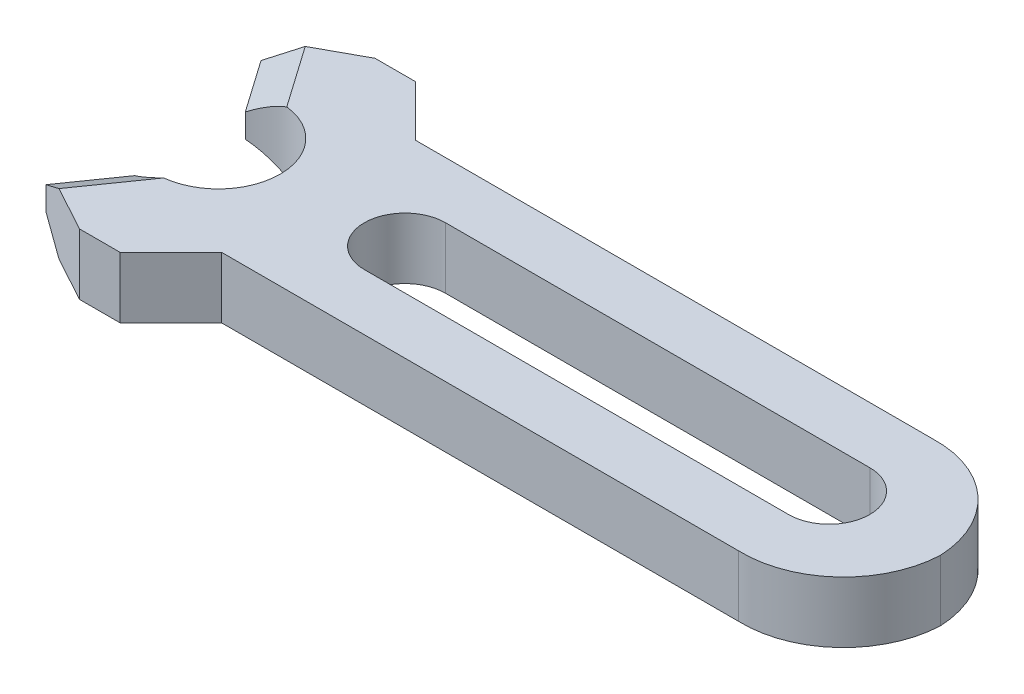
ISO-10303-21;
HEADER;
FILE_DESCRIPTION(('STEP AP214'),'2;1');
FILE_NAME('part.step','',(''),(''),'','','');
FILE_SCHEMA(('AUTOMOTIVE_DESIGN { 1 0 10303 214 1 1 1 1 }'));
ENDSEC;
DATA;
#1=APPLICATION_CONTEXT('core data for automotive mechanical design processes');
#2=APPLICATION_PROTOCOL_DEFINITION('international standard','automotive_design',2000,#1);
#3=PRODUCT_CONTEXT('',#1,'mechanical');
#4=PRODUCT('Part','Part','',(#3));
#5=PRODUCT_RELATED_PRODUCT_CATEGORY('part','',(#4));
#6=PRODUCT_DEFINITION_FORMATION('','',#4);
#7=PRODUCT_DEFINITION_CONTEXT('part definition',#1,'design');
#8=PRODUCT_DEFINITION('design','',#6,#7);
#9=PRODUCT_DEFINITION_SHAPE('','',#8);
#10=(LENGTH_UNIT() NAMED_UNIT(*) SI_UNIT(.MILLI.,.METRE.));
#11=(NAMED_UNIT(*) PLANE_ANGLE_UNIT() SI_UNIT($,.RADIAN.));
#12=(NAMED_UNIT(*) SI_UNIT($,.STERADIAN.) SOLID_ANGLE_UNIT());
#13=UNCERTAINTY_MEASURE_WITH_UNIT(LENGTH_MEASURE(1.E-05),#10,'distance_accuracy_value','');
#14=(GEOMETRIC_REPRESENTATION_CONTEXT(3) GLOBAL_UNCERTAINTY_ASSIGNED_CONTEXT((#13)) GLOBAL_UNIT_ASSIGNED_CONTEXT((#10,
#11,#12)) REPRESENTATION_CONTEXT('',''));
#15=CARTESIAN_POINT('',(0.,0.,0.));
#16=DIRECTION('',(0.,0.,1.));
#17=DIRECTION('',(1.,0.,0.));
#18=AXIS2_PLACEMENT_3D('',#15,#16,#17);
#19=CARTESIAN_POINT('',(7.60352570186957,3.8227,0.204369265688564));
#20=DIRECTION('',(0.,-1.,0.));
#21=DIRECTION('',(0.,0.,-1.));
#22=AXIS2_PLACEMENT_3D('',#19,#20,#21);
#23=CYLINDRICAL_SURFACE('',#22,6.35342707429372);
#24=CARTESIAN_POINT('',(7.60352570186957,0.,0.204369265688564));
#25=DIRECTION('',(0.,1.,0.));
#26=DIRECTION('',(0.,0.,1.));
#27=AXIS2_PLACEMENT_3D('',#24,#25,#26);
#28=CIRCLE('',#27,6.35342707429372);
#29=CARTESIAN_POINT('',(13.9507690040802,0.,-0.0758771453703794));
#30=VERTEX_POINT('',#29);
#31=CARTESIAN_POINT('',(7.39487386658286,0.,-6.14563073431144));
#32=VERTEX_POINT('',#31);
#33=EDGE_CURVE('E274',#30,#32,#28,.T.);
#34=ORIENTED_EDGE('',*,*,#33,.T.);
#35=DIRECTION('',(0.,-1.,0.));
#36=VECTOR('',#35,1.);
#37=CARTESIAN_POINT('',(7.39487386658286,3.8227,-6.14563073431144));
#38=LINE('',#37,#36);
#39=CARTESIAN_POINT('',(7.39487386658286,3.8227,-6.14563073431144));
#40=VERTEX_POINT('',#39);
#41=EDGE_CURVE('E334',#40,#32,#38,.T.);
#42=ORIENTED_EDGE('',*,*,#41,.F.);
#43=CARTESIAN_POINT('',(7.60352570186957,3.8227,0.204369265688564));
#44=DIRECTION('',(0.,1.,0.));
#45=DIRECTION('',(0.,0.,1.));
#46=AXIS2_PLACEMENT_3D('',#43,#44,#45);
#47=CIRCLE('',#46,6.35342707429372);
#48=CARTESIAN_POINT('',(13.9507690040802,3.8227,-0.0758771453703794));
#49=VERTEX_POINT('',#48);
#50=EDGE_CURVE('E275',#49,#40,#47,.T.);
#51=ORIENTED_EDGE('',*,*,#50,.F.);
#52=DIRECTION('',(0.,-1.,0.));
#53=VECTOR('',#52,1.);
#54=CARTESIAN_POINT('',(13.9507690040802,3.8227,-0.0758771453703568));
#55=LINE('',#54,#53);
#56=EDGE_CURVE('E202',#49,#30,#55,.T.);
#57=ORIENTED_EDGE('',*,*,#56,.T.);
#58=EDGE_LOOP('',(#34,#42,#51,#57));
#59=FACE_BOUND('',#58,.T.);
#60=ADVANCED_FACE('F35',(#59),#23,.T.);
#61=CARTESIAN_POINT('',(0.,3.8227,-6.14563073431143));
#62=DIRECTION('',(0.,0.,1.));
#63=DIRECTION('',(1.,0.,0.));
#64=AXIS2_PLACEMENT_3D('',#61,#62,#63);
#65=PLANE('',#64);
#66=DIRECTION('',(-1.,0.,0.));
#67=VECTOR('',#66,1.);
#68=CARTESIAN_POINT('',(0.,0.,-6.14563073431143));
#69=LINE('',#68,#67);
#70=CARTESIAN_POINT('',(-24.9538224628437,0.,-6.14563073431143));
#71=VERTEX_POINT('',#70);
#72=EDGE_CURVE('E299',#32,#71,#69,.T.);
#73=ORIENTED_EDGE('',*,*,#72,.T.);
#74=DIRECTION('',(0.,-1.,0.));
#75=VECTOR('',#74,1.);
#76=CARTESIAN_POINT('',(-24.9538224628437,3.8227,-6.14563073431143));
#77=LINE('',#76,#75);
#78=CARTESIAN_POINT('',(-24.9538224628437,3.8227,-6.14563073431143));
#79=VERTEX_POINT('',#78);
#80=EDGE_CURVE('E331',#79,#71,#77,.T.);
#81=ORIENTED_EDGE('',*,*,#80,.F.);
#82=DIRECTION('',(-1.,0.,0.));
#83=VECTOR('',#82,1.);
#84=CARTESIAN_POINT('',(0.,3.8227,-6.14563073431143));
#85=LINE('',#84,#83);
#86=EDGE_CURVE('E277',#40,#79,#85,.T.);
#87=ORIENTED_EDGE('',*,*,#86,.F.);
#88=ORIENTED_EDGE('',*,*,#41,.T.);
#89=EDGE_LOOP('',(#73,#81,#87,#88));
#90=FACE_BOUND('',#89,.T.);
#91=ADVANCED_FACE('F382',(#90),#65,.F.);
#92=CARTESIAN_POINT('',(-9.40409586426615,3.8227,9.40409586426614));
#93=DIRECTION('',(-0.707106781186548,0.,0.707106781186547));
#94=DIRECTION('',(0.707106781186547,0.,0.707106781186548));
#95=AXIS2_PLACEMENT_3D('',#92,#93,#94);
#96=PLANE('',#95);
#97=DIRECTION('',(-0.707106781186547,0.,-0.707106781186548));
#98=VECTOR('',#97,1.);
#99=CARTESIAN_POINT('',(-9.40409586426615,0.,9.40409586426614));
#100=LINE('',#99,#98);
#101=CARTESIAN_POINT('',(-28.1288224628437,0.,-9.32063073431143));
#102=VERTEX_POINT('',#101);
#103=EDGE_CURVE('E301',#71,#102,#100,.T.);
#104=ORIENTED_EDGE('',*,*,#103,.T.);
#105=DIRECTION('',(0.,-1.,0.));
#106=VECTOR('',#105,1.);
#107=CARTESIAN_POINT('',(-28.1288224628437,3.8227,-9.32063073431143));
#108=LINE('',#107,#106);
#109=CARTESIAN_POINT('',(-28.1288224628437,3.8227,-9.32063073431143));
#110=VERTEX_POINT('',#109);
#111=EDGE_CURVE('E328',#110,#102,#108,.T.);
#112=ORIENTED_EDGE('',*,*,#111,.F.);
#113=DIRECTION('',(-0.707106781186547,0.,-0.707106781186548));
#114=VECTOR('',#113,1.);
#115=CARTESIAN_POINT('',(-9.40409586426615,3.8227,9.40409586426614));
#116=LINE('',#115,#114);
#117=EDGE_CURVE('E280',#79,#110,#116,.T.);
#118=ORIENTED_EDGE('',*,*,#117,.F.);
#119=ORIENTED_EDGE('',*,*,#80,.T.);
#120=EDGE_LOOP('',(#104,#112,#118,#119));
#121=FACE_BOUND('',#120,.T.);
#122=ADVANCED_FACE('F388',(#121),#96,.F.);
#123=CARTESIAN_POINT('',(0.,3.8227,-9.3206307343114));
#124=DIRECTION('',(0.,0.,1.));
#125=DIRECTION('',(1.,0.,0.));
#126=AXIS2_PLACEMENT_3D('',#123,#124,#125);
#127=PLANE('',#126);
#128=DIRECTION('',(-1.,0.,0.));
#129=VECTOR('',#128,1.);
#130=CARTESIAN_POINT('',(0.,0.,-9.3206307343114));
#131=LINE('',#130,#129);
#132=CARTESIAN_POINT('',(-30.6688224628437,0.,-9.32063073431144));
#133=VERTEX_POINT('',#132);
#134=EDGE_CURVE('E303',#102,#133,#131,.T.);
#135=ORIENTED_EDGE('',*,*,#134,.T.);
#136=DIRECTION('',(0.,-1.,0.));
#137=VECTOR('',#136,1.);
#138=CARTESIAN_POINT('',(-30.6688224628437,3.8227,-9.32063073431144));
#139=LINE('',#138,#137);
#140=CARTESIAN_POINT('',(-30.6688224628437,3.8227,-9.32063073431144));
#141=VERTEX_POINT('',#140);
#142=EDGE_CURVE('E325',#141,#133,#139,.T.);
#143=ORIENTED_EDGE('',*,*,#142,.F.);
#144=DIRECTION('',(-1.,0.,0.));
#145=VECTOR('',#144,1.);
#146=CARTESIAN_POINT('',(0.,3.8227,-9.3206307343114));
#147=LINE('',#146,#145);
#148=EDGE_CURVE('E282',#110,#141,#147,.T.);
#149=ORIENTED_EDGE('',*,*,#148,.F.);
#150=ORIENTED_EDGE('',*,*,#111,.T.);
#151=EDGE_LOOP('',(#135,#143,#149,#150));
#152=FACE_BOUND('',#151,.T.);
#153=ADVANCED_FACE('F394',(#152),#127,.F.);
#154=CARTESIAN_POINT('',(-10.9532739393627,3.8227,-20.0768111805315));
#155=DIRECTION('',(0.478929164813691,0.,0.877853549910724));
#156=DIRECTION('',(0.877853549910724,0.,-0.478929164813691));
#157=AXIS2_PLACEMENT_3D('',#154,#155,#156);
#158=PLANE('',#157);
#159=DIRECTION('',(-0.877853549910724,0.,0.478929164813692));
#160=VECTOR('',#159,1.);
#161=CARTESIAN_POINT('',(-10.9532739393627,0.,-20.0768111805315));
#162=LINE('',#161,#160);
#163=CARTESIAN_POINT('',(-33.4943829838272,0.,-7.77909417552803));
#164=VERTEX_POINT('',#163);
#165=EDGE_CURVE('E305',#133,#164,#162,.T.);
#166=ORIENTED_EDGE('',*,*,#165,.T.);
#167=DIRECTION('',(0.761421306179294,-0.497668843247582,-0.41540741081116));
#168=VECTOR('',#167,1.);
#169=CARTESIAN_POINT('',(-33.3889183444022,-0.0689322254055946,-7.8366323510954));
#170=LINE('',#169,#168);
#171=CARTESIAN_POINT('',(-35.2844547158978,1.17,-6.80248758814867));
#172=VERTEX_POINT('',#171);
#173=EDGE_CURVE('E43',#164,#172,#170,.F.);
#174=ORIENTED_EDGE('',*,*,#173,.T.);
#175=DIRECTION('',(0.,-1.,0.));
#176=VECTOR('',#175,1.);
#177=CARTESIAN_POINT('',(-35.2844547158978,3.8227,-6.80248758814867));
#178=LINE('',#177,#176);
#179=CARTESIAN_POINT('',(-35.2844547158978,2.65270000000001,-6.80248758814867));
#180=VERTEX_POINT('',#179);
#181=EDGE_CURVE('E322',#180,#172,#178,.T.);
#182=ORIENTED_EDGE('',*,*,#181,.F.);
#183=DIRECTION('',(0.761421306179294,0.497668843247581,-0.41540741081116));
#184=VECTOR('',#183,1.);
#185=CARTESIAN_POINT('',(-31.6154994524651,5.05074784428992,-8.80415367497296));
#186=LINE('',#185,#184);
#187=CARTESIAN_POINT('',(-33.4943829838272,3.8227,-7.77909417552803));
#188=VERTEX_POINT('',#187);
#189=EDGE_CURVE('E50',#180,#188,#186,.T.);
#190=ORIENTED_EDGE('',*,*,#189,.T.);
#191=DIRECTION('',(-0.877853549910724,0.,0.478929164813692));
#192=VECTOR('',#191,1.);
#193=CARTESIAN_POINT('',(-10.9532739393627,3.8227,-20.0768111805315));
#194=LINE('',#193,#192);
#195=EDGE_CURVE('E284',#141,#188,#194,.T.);
#196=ORIENTED_EDGE('',*,*,#195,.F.);
#197=ORIENTED_EDGE('',*,*,#142,.T.);
#198=EDGE_LOOP('',(#166,#174,#182,#190,#196,#197));
#199=FACE_BOUND('',#198,.T.);
#200=ADVANCED_FACE('F348',(#199),#158,.F.);
#201=CARTESIAN_POINT('',(-20.4801007927129,3.8227,14.3403209583524));
#202=DIRECTION('',(0.819152044288988,0.,-0.573576436351051));
#203=DIRECTION('',(-0.573576436351051,0.,-0.819152044288988));
#204=AXIS2_PLACEMENT_3D('',#201,#202,#203);
#205=PLANE('',#204);
#206=ORIENTED_EDGE('',*,*,#181,.T.);
#207=DIRECTION('',(0.573576436351051,0.,0.819152044288988));
#208=VECTOR('',#207,1.);
#209=CARTESIAN_POINT('',(-20.4801007927129,1.17,14.3403209583524));
#210=LINE('',#209,#208);
#211=CARTESIAN_POINT('',(-32.9901489704936,1.17,-3.52587941099272));
#212=VERTEX_POINT('',#211);
#213=EDGE_CURVE('E339',#172,#212,#210,.T.);
#214=ORIENTED_EDGE('',*,*,#213,.T.);
#215=DIRECTION('',(0.,-1.,0.));
#216=VECTOR('',#215,1.);
#217=CARTESIAN_POINT('',(-32.9901489704936,3.8227,-3.52587941099272));
#218=LINE('',#217,#216);
#219=CARTESIAN_POINT('',(-32.9901489704936,2.65270000000001,-3.52587941099272));
#220=VERTEX_POINT('',#219);
#221=EDGE_CURVE('E319',#220,#212,#218,.T.);
#222=ORIENTED_EDGE('',*,*,#221,.F.);
#223=DIRECTION('',(-0.573576436351051,0.,-0.819152044288988));
#224=VECTOR('',#223,1.);
#225=CARTESIAN_POINT('',(-35.2844547158978,2.65270000000001,-6.80248758814867));
#226=LINE('',#225,#224);
#227=EDGE_CURVE('E337',#220,#180,#226,.T.);
#228=ORIENTED_EDGE('',*,*,#227,.T.);
#229=EDGE_LOOP('',(#206,#214,#222,#228));
#230=FACE_BOUND('',#229,.T.);
#231=ADVANCED_FACE('F352',(#230),#205,.F.);
#232=CARTESIAN_POINT('',(-31.2290451640129,3.8227,-0.0758771453703807));
#233=DIRECTION('',(0.,-1.,0.));
#234=DIRECTION('',(0.,0.,-1.));
#235=AXIS2_PLACEMENT_3D('',#232,#233,#234);
#236=CYLINDRICAL_SURFACE('',#235,3.87350000000001);
#237=ORIENTED_EDGE('',*,*,#221,.T.);
#238=CARTESIAN_POINT('',(-31.2290451640129,1.47959150810801,-0.0758771453703807));
#239=DIRECTION('',(0.409576022144494,0.866025403784438,-0.286788218175526));
#240=DIRECTION('',(0.70940647991622,-0.5,-0.496731764892158));
#241=AXIS2_PLACEMENT_3D('',#238,#239,#240);
#242=ELLIPSE('',#241,4.47273253541204,3.87350000000001);
#243=CARTESIAN_POINT('',(-30.7957648174462,0.,-3.92506802025292));
#244=VERTEX_POINT('',#243);
#245=EDGE_CURVE('E344',#212,#244,#242,.F.);
#246=ORIENTED_EDGE('',*,*,#245,.T.);
#247=CARTESIAN_POINT('',(-31.2290451640129,0.,-0.0758771453703807));
#248=DIRECTION('',(0.,1.,0.));
#249=DIRECTION('',(0.,0.,1.));
#250=AXIS2_PLACEMENT_3D('',#247,#248,#249);
#251=CIRCLE('',#250,3.87350000000001);
#252=CARTESIAN_POINT('',(-30.7957648174462,0.,3.77331372951217));
#253=VERTEX_POINT('',#252);
#254=EDGE_CURVE('E307',#253,#244,#251,.T.);
#255=ORIENTED_EDGE('',*,*,#254,.F.);
#256=CARTESIAN_POINT('',(-31.2290451640129,1.47959150810801,-0.0758771453703719));
#257=DIRECTION('',(-0.409576022144494,-0.866025403784438,-0.286788218175526));
#258=DIRECTION('',(0.709406479916219,-0.5,0.496731764892158));
#259=AXIS2_PLACEMENT_3D('',#256,#257,#258);
#260=ELLIPSE('',#259,4.47273253541204,3.87350000000001);
#261=CARTESIAN_POINT('',(-32.9901489704936,1.17,3.37412512025197));
#262=VERTEX_POINT('',#261);
#263=EDGE_CURVE('E260',#262,#253,#260,.F.);
#264=ORIENTED_EDGE('',*,*,#263,.F.);
#265=DIRECTION('',(0.,-1.,0.));
#266=VECTOR('',#265,1.);
#267=CARTESIAN_POINT('',(-32.9901489704936,3.8227,3.37412512025197));
#268=LINE('',#267,#266);
#269=CARTESIAN_POINT('',(-32.9901489704936,2.65270000000001,3.37412512025197));
#270=VERTEX_POINT('',#269);
#271=EDGE_CURVE('E239',#270,#262,#268,.T.);
#272=ORIENTED_EDGE('',*,*,#271,.F.);
#273=CARTESIAN_POINT('',(-31.2290451640129,2.343108491892,-0.0758771453703719));
#274=DIRECTION('',(0.409576022144494,-0.866025403784439,0.286788218175526));
#275=DIRECTION('',(-0.70940647991622,-0.5,-0.496731764892159));
#276=AXIS2_PLACEMENT_3D('',#273,#274,#275);
#277=ELLIPSE('',#276,4.47273253541204,3.87350000000001);
#278=CARTESIAN_POINT('',(-30.7957648174462,3.8227,3.77331372951217));
#279=VERTEX_POINT('',#278);
#280=EDGE_CURVE('E258',#279,#270,#277,.T.);
#281=ORIENTED_EDGE('',*,*,#280,.F.);
#282=CARTESIAN_POINT('',(-31.2290451640129,3.8227,-0.0758771453703807));
#283=DIRECTION('',(0.,1.,0.));
#284=DIRECTION('',(0.,0.,1.));
#285=AXIS2_PLACEMENT_3D('',#282,#283,#284);
#286=CIRCLE('',#285,3.87350000000001);
#287=CARTESIAN_POINT('',(-30.7957648174462,3.8227,-3.92506802025292));
#288=VERTEX_POINT('',#287);
#289=EDGE_CURVE('E286',#279,#288,#286,.T.);
#290=ORIENTED_EDGE('',*,*,#289,.T.);
#291=CARTESIAN_POINT('',(-31.2290451640129,2.343108491892,-0.0758771453703807));
#292=DIRECTION('',(-0.409576022144494,0.866025403784439,0.286788218175525));
#293=DIRECTION('',(-0.70940647991622,-0.5,0.496731764892158));
#294=AXIS2_PLACEMENT_3D('',#291,#292,#293);
#295=ELLIPSE('',#294,4.47273253541204,3.87350000000001);
#296=EDGE_CURVE('E342',#288,#220,#295,.T.);
#297=ORIENTED_EDGE('',*,*,#296,.T.);
#298=EDGE_LOOP('',(#237,#246,#255,#264,#272,#281,#290,#297));
#299=FACE_BOUND('',#298,.T.);
#300=ADVANCED_FACE('F357',(#299),#236,.F.);
#301=CARTESIAN_POINT('',(-19.5526468181524,3.8227,-0.0758771453703494));
#302=DIRECTION('',(0.,-1.,0.));
#303=DIRECTION('',(0.,0.,-1.));
#304=AXIS2_PLACEMENT_3D('',#301,#302,#303);
#305=CYLINDRICAL_SURFACE('',#304,2.54000000000001);
#306=CARTESIAN_POINT('',(-19.5526468181524,0.,-0.0758771453703494));
#307=DIRECTION('',(0.,1.,0.));
#308=DIRECTION('',(0.,0.,1.));
#309=AXIS2_PLACEMENT_3D('',#306,#307,#308);
#310=CIRCLE('',#309,2.54000000000001);
#311=CARTESIAN_POINT('',(-19.5526468181524,0.,-2.61587714537036));
#312=VERTEX_POINT('',#311);
#313=CARTESIAN_POINT('',(-19.5526468181524,0.,2.46412285462961));
#314=VERTEX_POINT('',#313);
#315=EDGE_CURVE('E309',#312,#314,#310,.T.);
#316=ORIENTED_EDGE('',*,*,#315,.F.);
#317=DIRECTION('',(0.,-1.,0.));
#318=VECTOR('',#317,1.);
#319=CARTESIAN_POINT('',(-19.5526468181524,3.8227,-2.61587714537036));
#320=LINE('',#319,#318);
#321=CARTESIAN_POINT('',(-19.5526468181524,3.8227,-2.61587714537036));
#322=VERTEX_POINT('',#321);
#323=EDGE_CURVE('E317',#322,#312,#320,.T.);
#324=ORIENTED_EDGE('',*,*,#323,.F.);
#325=CARTESIAN_POINT('',(-19.5526468181524,3.8227,-0.0758771453703494));
#326=DIRECTION('',(0.,1.,0.));
#327=DIRECTION('',(0.,0.,1.));
#328=AXIS2_PLACEMENT_3D('',#325,#326,#327);
#329=CIRCLE('',#328,2.54000000000001);
#330=CARTESIAN_POINT('',(-19.5526468181524,3.8227,2.46412285462961));
#331=VERTEX_POINT('',#330);
#332=EDGE_CURVE('E289',#322,#331,#329,.T.);
#333=ORIENTED_EDGE('',*,*,#332,.T.);
#334=DIRECTION('',(0.,-1.,0.));
#335=VECTOR('',#334,1.);
#336=CARTESIAN_POINT('',(-19.5526468181524,3.8227,2.46412285462961));
#337=LINE('',#336,#335);
#338=EDGE_CURVE('E236',#331,#314,#337,.T.);
#339=ORIENTED_EDGE('',*,*,#338,.T.);
#340=EDGE_LOOP('',(#316,#324,#333,#339));
#341=FACE_BOUND('',#340,.T.);
#342=ADVANCED_FACE('F405',(#341),#305,.F.);
#343=CARTESIAN_POINT('',(0.,3.8227,-2.61587714537037));
#344=DIRECTION('',(0.,0.,1.));
#345=DIRECTION('',(1.,0.,0.));
#346=AXIS2_PLACEMENT_3D('',#343,#344,#345);
#347=PLANE('',#346);
#348=DIRECTION('',(-1.,0.,0.));
#349=VECTOR('',#348,1.);
#350=CARTESIAN_POINT('',(0.,0.,-2.61587714537037));
#351=LINE('',#350,#349);
#352=CARTESIAN_POINT('',(6.99035318184758,0.,-2.61587714537037));
#353=VERTEX_POINT('',#352);
#354=EDGE_CURVE('E311',#353,#312,#351,.T.);
#355=ORIENTED_EDGE('',*,*,#354,.F.);
#356=DIRECTION('',(0.,-1.,0.));
#357=VECTOR('',#356,1.);
#358=CARTESIAN_POINT('',(6.99035318184758,3.8227,-2.61587714537037));
#359=LINE('',#358,#357);
#360=CARTESIAN_POINT('',(6.99035318184758,3.8227,-2.61587714537037));
#361=VERTEX_POINT('',#360);
#362=EDGE_CURVE('E297',#361,#353,#359,.T.);
#363=ORIENTED_EDGE('',*,*,#362,.F.);
#364=DIRECTION('',(-1.,0.,0.));
#365=VECTOR('',#364,1.);
#366=CARTESIAN_POINT('',(0.,3.8227,-2.61587714537037));
#367=LINE('',#366,#365);
#368=EDGE_CURVE('E291',#361,#322,#367,.T.);
#369=ORIENTED_EDGE('',*,*,#368,.T.);
#370=ORIENTED_EDGE('',*,*,#323,.T.);
#371=EDGE_LOOP('',(#355,#363,#369,#370));
#372=FACE_BOUND('',#371,.T.);
#373=ADVANCED_FACE('F408',(#372),#347,.T.);
#374=CARTESIAN_POINT('',(6.9903531818476,3.8227,-0.0758771453703676));
#375=DIRECTION('',(0.,-1.,0.));
#376=DIRECTION('',(0.,0.,-1.));
#377=AXIS2_PLACEMENT_3D('',#374,#375,#376);
#378=CYLINDRICAL_SURFACE('',#377,2.54);
#379=CARTESIAN_POINT('',(6.9903531818476,0.,-0.0758771453703676));
#380=DIRECTION('',(0.,1.,0.));
#381=DIRECTION('',(0.,0.,1.));
#382=AXIS2_PLACEMENT_3D('',#379,#380,#381);
#383=CIRCLE('',#382,2.54);
#384=CARTESIAN_POINT('',(6.99035318184758,0.,2.46412285462963));
#385=VERTEX_POINT('',#384);
#386=EDGE_CURVE('E278',#385,#353,#383,.T.);
#387=ORIENTED_EDGE('',*,*,#386,.F.);
#388=DIRECTION('',(0.,-1.,0.));
#389=VECTOR('',#388,1.);
#390=CARTESIAN_POINT('',(6.99035318184758,3.8227,2.46412285462963));
#391=LINE('',#390,#389);
#392=CARTESIAN_POINT('',(6.99035318184758,3.8227,2.46412285462963));
#393=VERTEX_POINT('',#392);
#394=EDGE_CURVE('E222',#393,#385,#391,.T.);
#395=ORIENTED_EDGE('',*,*,#394,.F.);
#396=CARTESIAN_POINT('',(6.9903531818476,3.8227,-0.0758771453703676));
#397=DIRECTION('',(0.,1.,0.));
#398=DIRECTION('',(0.,0.,1.));
#399=AXIS2_PLACEMENT_3D('',#396,#397,#398);
#400=CIRCLE('',#399,2.54);
#401=EDGE_CURVE('E294',#393,#361,#400,.T.);
#402=ORIENTED_EDGE('',*,*,#401,.T.);
#403=ORIENTED_EDGE('',*,*,#362,.T.);
#404=EDGE_LOOP('',(#387,#395,#402,#403));
#405=FACE_BOUND('',#404,.T.);
#406=ADVANCED_FACE('F412',(#405),#378,.F.);
#407=CARTESIAN_POINT('',(0.,3.8227,0.));
#408=DIRECTION('',(0.,1.,0.));
#409=DIRECTION('',(0.,0.,1.));
#410=AXIS2_PLACEMENT_3D('',#407,#408,#409);
#411=PLANE('',#410);
#412=ORIENTED_EDGE('',*,*,#401,.F.);
#413=DIRECTION('',(-1.,0.,0.));
#414=VECTOR('',#413,1.);
#415=CARTESIAN_POINT('',(0.,3.8227,2.46412285462962));
#416=LINE('',#415,#414);
#417=EDGE_CURVE('E219',#393,#331,#416,.T.);
#418=ORIENTED_EDGE('',*,*,#417,.T.);
#419=ORIENTED_EDGE('',*,*,#332,.F.);
#420=ORIENTED_EDGE('',*,*,#368,.F.);
#421=EDGE_LOOP('',(#412,#418,#419,#420));
#422=FACE_BOUND('',#421,.T.);
#423=ORIENTED_EDGE('',*,*,#195,.T.);
#424=DIRECTION('',(0.573576436351051,0.,0.819152044288989));
#425=VECTOR('',#424,1.);
#426=CARTESIAN_POINT('',(-31.3301378074897,3.8227,-4.68823174084037));
#427=LINE('',#426,#425);
#428=EDGE_CURVE('E11',#188,#288,#427,.T.);
#429=ORIENTED_EDGE('',*,*,#428,.T.);
#430=ORIENTED_EDGE('',*,*,#289,.F.);
#431=DIRECTION('',(0.573576436351051,0.,-0.819152044288988));
#432=VECTOR('',#431,1.);
#433=CARTESIAN_POINT('',(-31.3301378074897,3.8227,4.53647745009961));
#434=LINE('',#433,#432);
#435=CARTESIAN_POINT('',(-33.4943829838272,3.8227,7.62733988478727));
#436=VERTEX_POINT('',#435);
#437=EDGE_CURVE('E271',#436,#279,#434,.T.);
#438=ORIENTED_EDGE('',*,*,#437,.F.);
#439=DIRECTION('',(-0.877853549910724,0.,-0.478929164813692));
#440=VECTOR('',#439,1.);
#441=CARTESIAN_POINT('',(-10.9532739393627,3.8227,19.9250568897907));
#442=LINE('',#441,#440);
#443=CARTESIAN_POINT('',(-30.6688224628437,3.8227,9.16887644357069));
#444=VERTEX_POINT('',#443);
#445=EDGE_CURVE('E216',#444,#436,#442,.T.);
#446=ORIENTED_EDGE('',*,*,#445,.F.);
#447=DIRECTION('',(-1.,0.,0.));
#448=VECTOR('',#447,1.);
#449=CARTESIAN_POINT('',(0.,3.8227,9.16887644357065));
#450=LINE('',#449,#448);
#451=CARTESIAN_POINT('',(-28.1288224628437,3.8227,9.16887644357068));
#452=VERTEX_POINT('',#451);
#453=EDGE_CURVE('E213',#452,#444,#450,.T.);
#454=ORIENTED_EDGE('',*,*,#453,.F.);
#455=DIRECTION('',(-0.707106781186547,0.,0.707106781186548));
#456=VECTOR('',#455,1.);
#457=CARTESIAN_POINT('',(-9.40409586426614,3.8227,-9.55585015500689));
#458=LINE('',#457,#456);
#459=CARTESIAN_POINT('',(-24.9538224628437,3.8227,5.99387644357068));
#460=VERTEX_POINT('',#459);
#461=EDGE_CURVE('E189',#460,#452,#458,.T.);
#462=ORIENTED_EDGE('',*,*,#461,.F.);
#463=DIRECTION('',(-1.,0.,0.));
#464=VECTOR('',#463,1.);
#465=CARTESIAN_POINT('',(0.,3.8227,5.99387644357069));
#466=LINE('',#465,#464);
#467=CARTESIAN_POINT('',(7.39487386658285,3.8227,5.9938764435707));
#468=VERTEX_POINT('',#467);
#469=EDGE_CURVE('E182',#468,#460,#466,.T.);
#470=ORIENTED_EDGE('',*,*,#469,.F.);
#471=CARTESIAN_POINT('',(7.60352570186957,3.8227,-0.356123556429302));
#472=DIRECTION('',(0.,-1.,0.));
#473=DIRECTION('',(0.,0.,-1.));
#474=AXIS2_PLACEMENT_3D('',#471,#472,#473);
#475=CIRCLE('',#474,6.35342707429372);
#476=EDGE_CURVE('E186',#49,#468,#475,.T.);
#477=ORIENTED_EDGE('',*,*,#476,.F.);
#478=ORIENTED_EDGE('',*,*,#50,.T.);
#479=ORIENTED_EDGE('',*,*,#86,.T.);
#480=ORIENTED_EDGE('',*,*,#117,.T.);
#481=ORIENTED_EDGE('',*,*,#148,.T.);
#482=EDGE_LOOP('',(#423,#429,#430,#438,#446,#454,#462,#470,#477,#478,#479,#480,#481));
#483=FACE_BOUND('',#482,.T.);
#484=ADVANCED_FACE('F184',(#422,#483),#411,.T.);
#485=CARTESIAN_POINT('',(0.,0.,0.));
#486=DIRECTION('',(0.,1.,0.));
#487=DIRECTION('',(0.,0.,1.));
#488=AXIS2_PLACEMENT_3D('',#485,#486,#487);
#489=PLANE('',#488);
#490=DIRECTION('',(-1.,0.,0.));
#491=VECTOR('',#490,1.);
#492=CARTESIAN_POINT('',(0.,0.,2.46412285462962));
#493=LINE('',#492,#491);
#494=EDGE_CURVE('E206',#385,#314,#493,.T.);
#495=ORIENTED_EDGE('',*,*,#494,.F.);
#496=ORIENTED_EDGE('',*,*,#386,.T.);
#497=ORIENTED_EDGE('',*,*,#354,.T.);
#498=ORIENTED_EDGE('',*,*,#315,.T.);
#499=EDGE_LOOP('',(#495,#496,#497,#498));
#500=FACE_BOUND('',#499,.T.);
#501=ORIENTED_EDGE('',*,*,#254,.T.);
#502=DIRECTION('',(-0.573576436351051,0.,-0.819152044288989));
#503=VECTOR('',#502,1.);
#504=CARTESIAN_POINT('',(-18.820089629709,0.,13.1779686285048));
#505=LINE('',#504,#503);
#506=EDGE_CURVE('E58',#244,#164,#505,.T.);
#507=ORIENTED_EDGE('',*,*,#506,.T.);
#508=ORIENTED_EDGE('',*,*,#165,.F.);
#509=ORIENTED_EDGE('',*,*,#134,.F.);
#510=ORIENTED_EDGE('',*,*,#103,.F.);
#511=ORIENTED_EDGE('',*,*,#72,.F.);
#512=ORIENTED_EDGE('',*,*,#33,.F.);
#513=CARTESIAN_POINT('',(7.60352570186957,0.,-0.356123556429302));
#514=DIRECTION('',(0.,-1.,0.));
#515=DIRECTION('',(0.,0.,-1.));
#516=AXIS2_PLACEMENT_3D('',#513,#514,#515);
#517=CIRCLE('',#516,6.35342707429372);
#518=CARTESIAN_POINT('',(7.39487386658285,0.,5.9938764435707));
#519=VERTEX_POINT('',#518);
#520=EDGE_CURVE('E223',#30,#519,#517,.T.);
#521=ORIENTED_EDGE('',*,*,#520,.T.);
#522=DIRECTION('',(-1.,0.,0.));
#523=VECTOR('',#522,1.);
#524=CARTESIAN_POINT('',(0.,0.,5.99387644357069));
#525=LINE('',#524,#523);
#526=CARTESIAN_POINT('',(-24.9538224628437,0.,5.99387644357068));
#527=VERTEX_POINT('',#526);
#528=EDGE_CURVE('E198',#519,#527,#525,.T.);
#529=ORIENTED_EDGE('',*,*,#528,.T.);
#530=DIRECTION('',(-0.707106781186547,0.,0.707106781186548));
#531=VECTOR('',#530,1.);
#532=CARTESIAN_POINT('',(-9.40409586426614,0.,-9.55585015500689));
#533=LINE('',#532,#531);
#534=CARTESIAN_POINT('',(-28.1288224628437,0.,9.16887644357068));
#535=VERTEX_POINT('',#534);
#536=EDGE_CURVE('E226',#527,#535,#533,.T.);
#537=ORIENTED_EDGE('',*,*,#536,.T.);
#538=DIRECTION('',(-1.,0.,0.));
#539=VECTOR('',#538,1.);
#540=CARTESIAN_POINT('',(0.,0.,9.16887644357065));
#541=LINE('',#540,#539);
#542=CARTESIAN_POINT('',(-30.6688224628437,0.,9.16887644357069));
#543=VERTEX_POINT('',#542);
#544=EDGE_CURVE('E229',#535,#543,#541,.T.);
#545=ORIENTED_EDGE('',*,*,#544,.T.);
#546=DIRECTION('',(-0.877853549910724,0.,-0.478929164813692));
#547=VECTOR('',#546,1.);
#548=CARTESIAN_POINT('',(-10.9532739393627,0.,19.9250568897907));
#549=LINE('',#548,#547);
#550=CARTESIAN_POINT('',(-33.4943829838272,0.,7.62733988478727));
#551=VERTEX_POINT('',#550);
#552=EDGE_CURVE('E209',#543,#551,#549,.T.);
#553=ORIENTED_EDGE('',*,*,#552,.T.);
#554=DIRECTION('',(-0.573576436351051,0.,0.819152044288988));
#555=VECTOR('',#554,1.);
#556=CARTESIAN_POINT('',(-18.820089629709,0.,-13.3297229192455));
#557=LINE('',#556,#555);
#558=EDGE_CURVE('E263',#253,#551,#557,.T.);
#559=ORIENTED_EDGE('',*,*,#558,.F.);
#560=EDGE_LOOP('',(#501,#507,#508,#509,#510,#511,#512,#521,#529,#537,#545,#553,#559));
#561=FACE_BOUND('',#560,.T.);
#562=ADVANCED_FACE('F359',(#500,#561),#489,.F.);
#563=CARTESIAN_POINT('',(-20.4801007927129,1.17,14.3403209583524));
#564=DIRECTION('',(0.409576022144494,0.866025403784438,-0.286788218175526));
#565=DIRECTION('',(0.573576436351051,0.,0.819152044288988));
#566=AXIS2_PLACEMENT_3D('',#563,#564,#565);
#567=PLANE('',#566);
#568=ORIENTED_EDGE('',*,*,#173,.F.);
#569=ORIENTED_EDGE('',*,*,#506,.F.);
#570=ORIENTED_EDGE('',*,*,#245,.F.);
#571=ORIENTED_EDGE('',*,*,#213,.F.);
#572=EDGE_LOOP('',(#568,#569,#570,#571));
#573=FACE_BOUND('',#572,.T.);
#574=ADVANCED_FACE('F355',(#573),#567,.F.);
#575=CARTESIAN_POINT('',(-18.820089629709,3.8227,13.1779686285048));
#576=DIRECTION('',(-0.409576022144494,0.866025403784439,0.286788218175525));
#577=DIRECTION('',(-0.573576436351051,0.,-0.819152044288988));
#578=AXIS2_PLACEMENT_3D('',#575,#576,#577);
#579=PLANE('',#578);
#580=ORIENTED_EDGE('',*,*,#189,.F.);
#581=ORIENTED_EDGE('',*,*,#227,.F.);
#582=ORIENTED_EDGE('',*,*,#296,.F.);
#583=ORIENTED_EDGE('',*,*,#428,.F.);
#584=EDGE_LOOP('',(#580,#581,#582,#583));
#585=FACE_BOUND('',#584,.T.);
#586=ADVANCED_FACE('F37',(#585),#579,.T.);
#587=CARTESIAN_POINT('',(7.60352570186957,3.8227,-0.356123556429302));
#588=DIRECTION('',(0.,-1.,0.));
#589=DIRECTION('',(0.,0.,1.));
#590=AXIS2_PLACEMENT_3D('',#587,#588,#589);
#591=CYLINDRICAL_SURFACE('',#590,6.35342707429372);
#592=ORIENTED_EDGE('',*,*,#520,.F.);
#593=ORIENTED_EDGE('',*,*,#56,.F.);
#594=ORIENTED_EDGE('',*,*,#476,.T.);
#595=DIRECTION('',(0.,-1.,0.));
#596=VECTOR('',#595,1.);
#597=CARTESIAN_POINT('',(7.39487386658285,3.8227,5.9938764435707));
#598=LINE('',#597,#596);
#599=EDGE_CURVE('E195',#468,#519,#598,.T.);
#600=ORIENTED_EDGE('',*,*,#599,.T.);
#601=EDGE_LOOP('',(#592,#593,#594,#600));
#602=FACE_BOUND('',#601,.T.);
#603=ADVANCED_FACE('F205',(#602),#591,.T.);
#604=CARTESIAN_POINT('',(0.,3.8227,5.99387644357069));
#605=DIRECTION('',(0.,0.,-1.));
#606=DIRECTION('',(1.,0.,0.));
#607=AXIS2_PLACEMENT_3D('',#604,#605,#606);
#608=PLANE('',#607);
#609=ORIENTED_EDGE('',*,*,#528,.F.);
#610=ORIENTED_EDGE('',*,*,#599,.F.);
#611=ORIENTED_EDGE('',*,*,#469,.T.);
#612=DIRECTION('',(0.,-1.,0.));
#613=VECTOR('',#612,1.);
#614=CARTESIAN_POINT('',(-24.9538224628437,3.8227,5.99387644357068));
#615=LINE('',#614,#613);
#616=EDGE_CURVE('E203',#460,#527,#615,.T.);
#617=ORIENTED_EDGE('',*,*,#616,.T.);
#618=EDGE_LOOP('',(#609,#610,#611,#617));
#619=FACE_BOUND('',#618,.T.);
#620=ADVANCED_FACE('F196',(#619),#608,.F.);
#621=CARTESIAN_POINT('',(-9.40409586426614,3.8227,-9.55585015500689));
#622=DIRECTION('',(-0.707106781186548,0.,-0.707106781186547));
#623=DIRECTION('',(0.707106781186547,0.,-0.707106781186548));
#624=AXIS2_PLACEMENT_3D('',#621,#622,#623);
#625=PLANE('',#624);
#626=ORIENTED_EDGE('',*,*,#536,.F.);
#627=ORIENTED_EDGE('',*,*,#616,.F.);
#628=ORIENTED_EDGE('',*,*,#461,.T.);
#629=DIRECTION('',(0.,-1.,0.));
#630=VECTOR('',#629,1.);
#631=CARTESIAN_POINT('',(-28.1288224628437,3.8227,9.16887644357068));
#632=LINE('',#631,#630);
#633=EDGE_CURVE('E248',#452,#535,#632,.T.);
#634=ORIENTED_EDGE('',*,*,#633,.T.);
#635=EDGE_LOOP('',(#626,#627,#628,#634));
#636=FACE_BOUND('',#635,.T.);
#637=ADVANCED_FACE('F430',(#636),#625,.F.);
#638=CARTESIAN_POINT('',(0.,3.8227,9.16887644357065));
#639=DIRECTION('',(0.,0.,-1.));
#640=DIRECTION('',(1.,0.,0.));
#641=AXIS2_PLACEMENT_3D('',#638,#639,#640);
#642=PLANE('',#641);
#643=ORIENTED_EDGE('',*,*,#544,.F.);
#644=ORIENTED_EDGE('',*,*,#633,.F.);
#645=ORIENTED_EDGE('',*,*,#453,.T.);
#646=DIRECTION('',(0.,-1.,0.));
#647=VECTOR('',#646,1.);
#648=CARTESIAN_POINT('',(-30.6688224628437,3.8227,9.16887644357069));
#649=LINE('',#648,#647);
#650=EDGE_CURVE('E245',#444,#543,#649,.T.);
#651=ORIENTED_EDGE('',*,*,#650,.T.);
#652=EDGE_LOOP('',(#643,#644,#645,#651));
#653=FACE_BOUND('',#652,.T.);
#654=ADVANCED_FACE('F433',(#653),#642,.F.);
#655=CARTESIAN_POINT('',(-10.9532739393627,3.8227,19.9250568897907));
#656=DIRECTION('',(0.478929164813692,0.,-0.877853549910724));
#657=DIRECTION('',(0.877853549910724,0.,0.478929164813692));
#658=AXIS2_PLACEMENT_3D('',#655,#656,#657);
#659=PLANE('',#658);
#660=ORIENTED_EDGE('',*,*,#552,.F.);
#661=ORIENTED_EDGE('',*,*,#650,.F.);
#662=ORIENTED_EDGE('',*,*,#445,.T.);
#663=DIRECTION('',(0.761421306179294,0.497668843247581,0.41540741081116));
#664=VECTOR('',#663,1.);
#665=CARTESIAN_POINT('',(-31.6154994524651,5.05074784428992,8.6523993842322));
#666=LINE('',#665,#664);
#667=CARTESIAN_POINT('',(-35.2844547158978,2.65270000000001,6.65073329740791));
#668=VERTEX_POINT('',#667);
#669=EDGE_CURVE('E265',#668,#436,#666,.T.);
#670=ORIENTED_EDGE('',*,*,#669,.F.);
#671=DIRECTION('',(0.,-1.,0.));
#672=VECTOR('',#671,1.);
#673=CARTESIAN_POINT('',(-35.2844547158978,3.8227,6.65073329740791));
#674=LINE('',#673,#672);
#675=CARTESIAN_POINT('',(-35.2844547158978,1.17,6.65073329740791));
#676=VERTEX_POINT('',#675);
#677=EDGE_CURVE('E242',#668,#676,#674,.T.);
#678=ORIENTED_EDGE('',*,*,#677,.T.);
#679=DIRECTION('',(0.761421306179294,-0.497668843247582,0.41540741081116));
#680=VECTOR('',#679,1.);
#681=CARTESIAN_POINT('',(-33.3889183444022,-0.0689322254055946,7.68487806035465));
#682=LINE('',#681,#680);
#683=EDGE_CURVE('E268',#551,#676,#682,.F.);
#684=ORIENTED_EDGE('',*,*,#683,.F.);
#685=EDGE_LOOP('',(#660,#661,#662,#670,#678,#684));
#686=FACE_BOUND('',#685,.T.);
#687=ADVANCED_FACE('F437',(#686),#659,.F.);
#688=CARTESIAN_POINT('',(-20.4801007927129,3.8227,-14.4920752490932));
#689=DIRECTION('',(0.819152044288988,0.,0.573576436351051));
#690=DIRECTION('',(-0.573576436351051,0.,0.819152044288988));
#691=AXIS2_PLACEMENT_3D('',#688,#689,#690);
#692=PLANE('',#691);
#693=ORIENTED_EDGE('',*,*,#677,.F.);
#694=DIRECTION('',(-0.573576436351051,0.,0.819152044288988));
#695=VECTOR('',#694,1.);
#696=CARTESIAN_POINT('',(-35.2844547158978,2.65270000000001,6.65073329740792));
#697=LINE('',#696,#695);
#698=EDGE_CURVE('E253',#270,#668,#697,.T.);
#699=ORIENTED_EDGE('',*,*,#698,.F.);
#700=ORIENTED_EDGE('',*,*,#271,.T.);
#701=DIRECTION('',(0.573576436351051,0.,-0.819152044288988));
#702=VECTOR('',#701,1.);
#703=CARTESIAN_POINT('',(-20.4801007927129,1.17,-14.4920752490932));
#704=LINE('',#703,#702);
#705=EDGE_CURVE('E255',#676,#262,#704,.T.);
#706=ORIENTED_EDGE('',*,*,#705,.F.);
#707=EDGE_LOOP('',(#693,#699,#700,#706));
#708=FACE_BOUND('',#707,.T.);
#709=ADVANCED_FACE('F368',(#708),#692,.F.);
#710=CARTESIAN_POINT('',(0.,3.8227,2.46412285462962));
#711=DIRECTION('',(0.,0.,-1.));
#712=DIRECTION('',(1.,0.,0.));
#713=AXIS2_PLACEMENT_3D('',#710,#711,#712);
#714=PLANE('',#713);
#715=ORIENTED_EDGE('',*,*,#494,.T.);
#716=ORIENTED_EDGE('',*,*,#338,.F.);
#717=ORIENTED_EDGE('',*,*,#417,.F.);
#718=ORIENTED_EDGE('',*,*,#394,.T.);
#719=EDGE_LOOP('',(#715,#716,#717,#718));
#720=FACE_BOUND('',#719,.T.);
#721=ADVANCED_FACE('F426',(#720),#714,.T.);
#722=CARTESIAN_POINT('',(-20.4801007927129,1.17,-14.4920752490932));
#723=DIRECTION('',(0.409576022144494,0.866025403784438,0.286788218175526));
#724=DIRECTION('',(0.573576436351051,0.,-0.819152044288988));
#725=AXIS2_PLACEMENT_3D('',#722,#723,#724);
#726=PLANE('',#725);
#727=ORIENTED_EDGE('',*,*,#683,.T.);
#728=ORIENTED_EDGE('',*,*,#705,.T.);
#729=ORIENTED_EDGE('',*,*,#263,.T.);
#730=ORIENTED_EDGE('',*,*,#558,.T.);
#731=EDGE_LOOP('',(#727,#728,#729,#730));
#732=FACE_BOUND('',#731,.T.);
#733=ADVANCED_FACE('F362',(#732),#726,.F.);
#734=CARTESIAN_POINT('',(-18.820089629709,3.8227,-13.3297229192455));
#735=DIRECTION('',(-0.409576022144494,0.866025403784439,-0.286788218175526));
#736=DIRECTION('',(-0.573576436351051,0.,0.819152044288988));
#737=AXIS2_PLACEMENT_3D('',#734,#735,#736);
#738=PLANE('',#737);
#739=ORIENTED_EDGE('',*,*,#669,.T.);
#740=ORIENTED_EDGE('',*,*,#437,.T.);
#741=ORIENTED_EDGE('',*,*,#280,.T.);
#742=ORIENTED_EDGE('',*,*,#698,.T.);
#743=EDGE_LOOP('',(#739,#740,#741,#742));
#744=FACE_BOUND('',#743,.T.);
#745=ADVANCED_FACE('F371',(#744),#738,.T.);
#746=CLOSED_SHELL('',(#60,#91,#122,#153,#200,#231,#300,#342,#373,#406,#484,#562,#574,#586,#603,
#620,#637,#654,#687,#709,#721,#733,#745));
#747=MANIFOLD_SOLID_BREP('B2',#746);
#748=ADVANCED_BREP_SHAPE_REPRESENTATION('',(#18,#747),#14);
#749=SHAPE_DEFINITION_REPRESENTATION(#9,#748);
ENDSEC;
END-ISO-10303-21;
